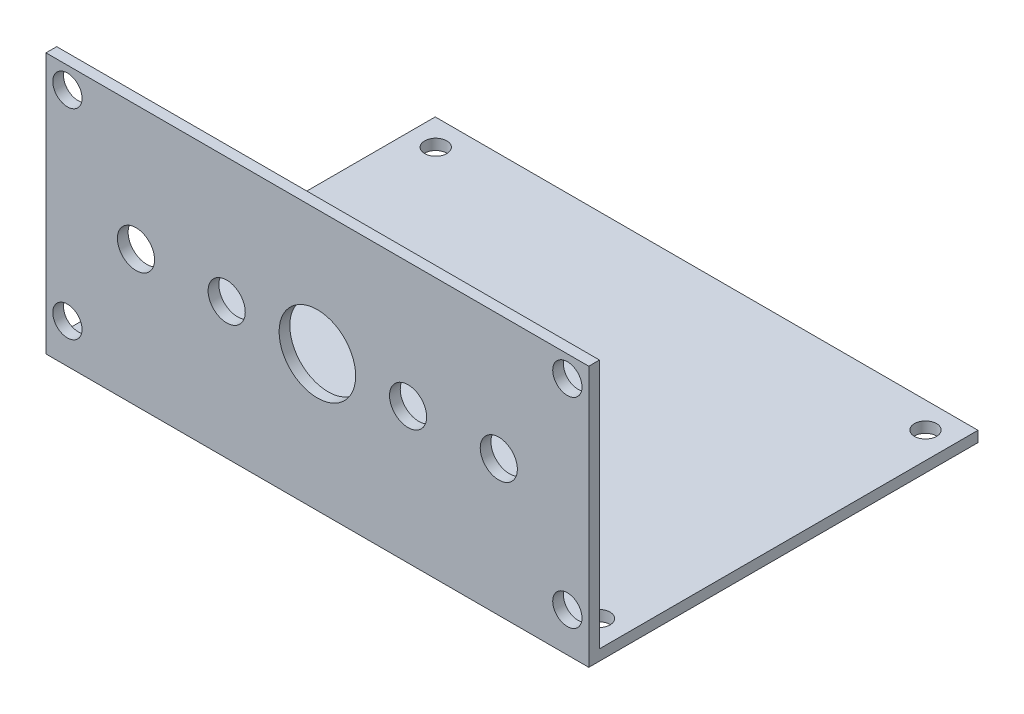
ISO-10303-21;
HEADER;
FILE_DESCRIPTION(('STEP AP214'),'2;1');
FILE_NAME('part.step','',(''),(''),'','','');
FILE_SCHEMA(('AUTOMOTIVE_DESIGN { 1 0 10303 214 1 1 1 1 }'));
ENDSEC;
DATA;
#1=APPLICATION_CONTEXT('core data for automotive mechanical design processes');
#2=APPLICATION_PROTOCOL_DEFINITION('international standard','automotive_design',2000,#1);
#3=PRODUCT_CONTEXT('',#1,'mechanical');
#4=PRODUCT('Part','Part','',(#3));
#5=PRODUCT_RELATED_PRODUCT_CATEGORY('part','',(#4));
#6=PRODUCT_DEFINITION_FORMATION('','',#4);
#7=PRODUCT_DEFINITION_CONTEXT('part definition',#1,'design');
#8=PRODUCT_DEFINITION('design','',#6,#7);
#9=PRODUCT_DEFINITION_SHAPE('','',#8);
#10=(LENGTH_UNIT() NAMED_UNIT(*) SI_UNIT(.MILLI.,.METRE.));
#11=(NAMED_UNIT(*) PLANE_ANGLE_UNIT() SI_UNIT($,.RADIAN.));
#12=(NAMED_UNIT(*) SI_UNIT($,.STERADIAN.) SOLID_ANGLE_UNIT());
#13=UNCERTAINTY_MEASURE_WITH_UNIT(LENGTH_MEASURE(1.E-05),#10,'distance_accuracy_value','');
#14=(GEOMETRIC_REPRESENTATION_CONTEXT(3) GLOBAL_UNCERTAINTY_ASSIGNED_CONTEXT((#13)) GLOBAL_UNIT_ASSIGNED_CONTEXT((#10,
#11,#12)) REPRESENTATION_CONTEXT('',''));
#15=CARTESIAN_POINT('',(0.,0.,0.));
#16=DIRECTION('',(0.,0.,1.));
#17=DIRECTION('',(1.,0.,0.));
#18=AXIS2_PLACEMENT_3D('',#15,#16,#17);
#19=CARTESIAN_POINT('',(0.,1.5,0.));
#20=DIRECTION('',(0.,1.,0.));
#21=DIRECTION('',(0.,0.,1.));
#22=AXIS2_PLACEMENT_3D('',#19,#20,#21);
#23=PLANE('',#22);
#24=DIRECTION('',(-1.,0.,0.));
#25=VECTOR('',#24,1.);
#26=CARTESIAN_POINT('',(-38.,1.5,26.5));
#27=LINE('',#26,#25);
#28=CARTESIAN_POINT('',(38.,1.5,26.5));
#29=VERTEX_POINT('',#28);
#30=CARTESIAN_POINT('',(-38.,1.5,26.5));
#31=VERTEX_POINT('',#30);
#32=EDGE_CURVE('E50',#29,#31,#27,.T.);
#33=ORIENTED_EDGE('',*,*,#32,.F.);
#34=DIRECTION('',(0.,0.,-1.));
#35=VECTOR('',#34,1.);
#36=CARTESIAN_POINT('',(38.,1.5,26.5));
#37=LINE('',#36,#35);
#38=CARTESIAN_POINT('',(38.,1.5,-26.5));
#39=VERTEX_POINT('',#38);
#40=EDGE_CURVE('E99',#29,#39,#37,.T.);
#41=ORIENTED_EDGE('',*,*,#40,.T.);
#42=DIRECTION('',(-1.,0.,0.));
#43=VECTOR('',#42,1.);
#44=CARTESIAN_POINT('',(38.,1.5,-26.5));
#45=LINE('',#44,#43);
#46=CARTESIAN_POINT('',(-38.,1.5,-26.5));
#47=VERTEX_POINT('',#46);
#48=EDGE_CURVE('E56',#39,#47,#45,.T.);
#49=ORIENTED_EDGE('',*,*,#48,.T.);
#50=DIRECTION('',(0.,0.,1.));
#51=VECTOR('',#50,1.);
#52=CARTESIAN_POINT('',(-38.,1.5,26.5));
#53=LINE('',#52,#51);
#54=EDGE_CURVE('E76',#47,#31,#53,.T.);
#55=ORIENTED_EDGE('',*,*,#54,.T.);
#56=EDGE_LOOP('',(#33,#41,#49,#55));
#57=FACE_BOUND('',#56,.T.);
#58=CARTESIAN_POINT('',(34.29,1.5,22.86));
#59=DIRECTION('',(0.,1.,0.));
#60=DIRECTION('',(0.,0.,1.));
#61=AXIS2_PLACEMENT_3D('',#58,#59,#60);
#62=CIRCLE('',#61,1.55);
#63=CARTESIAN_POINT('',(34.29,1.5,24.41));
#64=VERTEX_POINT('',#63);
#65=EDGE_CURVE('E108',#64,#64,#62,.T.);
#66=ORIENTED_EDGE('',*,*,#65,.F.);
#67=EDGE_LOOP('',(#66));
#68=FACE_BOUND('',#67,.T.);
#69=CARTESIAN_POINT('',(-34.29,1.5,-22.86));
#70=DIRECTION('',(0.,1.,0.));
#71=DIRECTION('',(0.,0.,1.));
#72=AXIS2_PLACEMENT_3D('',#69,#70,#71);
#73=CIRCLE('',#72,1.55);
#74=CARTESIAN_POINT('',(-34.29,1.5,-21.31));
#75=VERTEX_POINT('',#74);
#76=EDGE_CURVE('E91',#75,#75,#73,.T.);
#77=ORIENTED_EDGE('',*,*,#76,.F.);
#78=EDGE_LOOP('',(#77));
#79=FACE_BOUND('',#78,.T.);
#80=CARTESIAN_POINT('',(-34.29,1.5,22.86));
#81=DIRECTION('',(0.,1.,0.));
#82=DIRECTION('',(0.,0.,1.));
#83=AXIS2_PLACEMENT_3D('',#80,#81,#82);
#84=CIRCLE('',#83,1.55);
#85=CARTESIAN_POINT('',(-34.29,1.5,24.41));
#86=VERTEX_POINT('',#85);
#87=EDGE_CURVE('E103',#86,#86,#84,.T.);
#88=ORIENTED_EDGE('',*,*,#87,.F.);
#89=EDGE_LOOP('',(#88));
#90=FACE_BOUND('',#89,.T.);
#91=CARTESIAN_POINT('',(34.29,1.5,-22.86));
#92=DIRECTION('',(0.,1.,0.));
#93=DIRECTION('',(0.,0.,1.));
#94=AXIS2_PLACEMENT_3D('',#91,#92,#93);
#95=CIRCLE('',#94,1.55);
#96=CARTESIAN_POINT('',(34.29,1.5,-21.31));
#97=VERTEX_POINT('',#96);
#98=EDGE_CURVE('E114',#97,#97,#95,.T.);
#99=ORIENTED_EDGE('',*,*,#98,.F.);
#100=EDGE_LOOP('',(#99));
#101=FACE_BOUND('',#100,.T.);
#102=ADVANCED_FACE('F35',(#57,#68,#79,#90,#101),#23,.T.);
#103=CARTESIAN_POINT('',(0.,0.,0.));
#104=DIRECTION('',(0.,1.,0.));
#105=DIRECTION('',(0.,0.,1.));
#106=AXIS2_PLACEMENT_3D('',#103,#104,#105);
#107=PLANE('',#106);
#108=DIRECTION('',(0.,0.,1.));
#109=VECTOR('',#108,1.);
#110=CARTESIAN_POINT('',(-38.,0.,26.5));
#111=LINE('',#110,#109);
#112=CARTESIAN_POINT('',(-38.,0.,-26.5));
#113=VERTEX_POINT('',#112);
#114=CARTESIAN_POINT('',(-38.,0.,28.));
#115=VERTEX_POINT('',#114);
#116=EDGE_CURVE('E83',#113,#115,#111,.T.);
#117=ORIENTED_EDGE('',*,*,#116,.F.);
#118=DIRECTION('',(-1.,0.,0.));
#119=VECTOR('',#118,1.);
#120=CARTESIAN_POINT('',(38.,0.,-26.5));
#121=LINE('',#120,#119);
#122=CARTESIAN_POINT('',(38.,0.,-26.5));
#123=VERTEX_POINT('',#122);
#124=EDGE_CURVE('E68',#123,#113,#121,.T.);
#125=ORIENTED_EDGE('',*,*,#124,.F.);
#126=DIRECTION('',(0.,0.,-1.));
#127=VECTOR('',#126,1.);
#128=CARTESIAN_POINT('',(38.,0.,26.5));
#129=LINE('',#128,#127);
#130=CARTESIAN_POINT('',(38.,0.,28.));
#131=VERTEX_POINT('',#130);
#132=EDGE_CURVE('E77',#131,#123,#129,.T.);
#133=ORIENTED_EDGE('',*,*,#132,.F.);
#134=DIRECTION('',(1.,0.,0.));
#135=VECTOR('',#134,1.);
#136=CARTESIAN_POINT('',(-38.,0.,28.));
#137=LINE('',#136,#135);
#138=EDGE_CURVE('E89',#115,#131,#137,.T.);
#139=ORIENTED_EDGE('',*,*,#138,.F.);
#140=EDGE_LOOP('',(#117,#125,#133,#139));
#141=FACE_BOUND('',#140,.T.);
#142=CARTESIAN_POINT('',(-34.29,0.,-22.86));
#143=DIRECTION('',(0.,1.,0.));
#144=DIRECTION('',(0.,0.,1.));
#145=AXIS2_PLACEMENT_3D('',#142,#143,#144);
#146=CIRCLE('',#145,1.55);
#147=CARTESIAN_POINT('',(-34.29,0.,-21.31));
#148=VERTEX_POINT('',#147);
#149=EDGE_CURVE('E95',#148,#148,#146,.T.);
#150=ORIENTED_EDGE('',*,*,#149,.T.);
#151=EDGE_LOOP('',(#150));
#152=FACE_BOUND('',#151,.T.);
#153=CARTESIAN_POINT('',(-34.29,0.,22.86));
#154=DIRECTION('',(0.,1.,0.));
#155=DIRECTION('',(0.,0.,1.));
#156=AXIS2_PLACEMENT_3D('',#153,#154,#155);
#157=CIRCLE('',#156,1.55);
#158=CARTESIAN_POINT('',(-34.29,0.,24.41));
#159=VERTEX_POINT('',#158);
#160=EDGE_CURVE('E105',#159,#159,#157,.T.);
#161=ORIENTED_EDGE('',*,*,#160,.T.);
#162=EDGE_LOOP('',(#161));
#163=FACE_BOUND('',#162,.T.);
#164=CARTESIAN_POINT('',(34.29,0.,22.86));
#165=DIRECTION('',(0.,1.,0.));
#166=DIRECTION('',(0.,0.,1.));
#167=AXIS2_PLACEMENT_3D('',#164,#165,#166);
#168=CIRCLE('',#167,1.55);
#169=CARTESIAN_POINT('',(34.29,0.,24.41));
#170=VERTEX_POINT('',#169);
#171=EDGE_CURVE('E111',#170,#170,#168,.T.);
#172=ORIENTED_EDGE('',*,*,#171,.T.);
#173=EDGE_LOOP('',(#172));
#174=FACE_BOUND('',#173,.T.);
#175=CARTESIAN_POINT('',(34.29,0.,-22.86));
#176=DIRECTION('',(0.,1.,0.));
#177=DIRECTION('',(0.,0.,1.));
#178=AXIS2_PLACEMENT_3D('',#175,#176,#177);
#179=CIRCLE('',#178,1.55);
#180=CARTESIAN_POINT('',(34.29,0.,-21.31));
#181=VERTEX_POINT('',#180);
#182=EDGE_CURVE('E117',#181,#181,#179,.T.);
#183=ORIENTED_EDGE('',*,*,#182,.T.);
#184=EDGE_LOOP('',(#183));
#185=FACE_BOUND('',#184,.T.);
#186=ADVANCED_FACE('F86',(#141,#152,#163,#174,#185),#107,.F.);
#187=CARTESIAN_POINT('',(-38.,1.5,26.5));
#188=DIRECTION('',(1.,0.,0.));
#189=DIRECTION('',(0.,0.,-1.));
#190=AXIS2_PLACEMENT_3D('',#187,#188,#189);
#191=PLANE('',#190);
#192=ORIENTED_EDGE('',*,*,#116,.T.);
#193=DIRECTION('',(0.,-1.,0.));
#194=VECTOR('',#193,1.);
#195=CARTESIAN_POINT('',(-38.,1.5,28.));
#196=LINE('',#195,#194);
#197=CARTESIAN_POINT('',(-38.,36.52,28.));
#198=VERTEX_POINT('',#197);
#199=EDGE_CURVE('E126',#198,#115,#196,.T.);
#200=ORIENTED_EDGE('',*,*,#199,.F.);
#201=DIRECTION('',(0.,0.,1.));
#202=VECTOR('',#201,1.);
#203=CARTESIAN_POINT('',(-38.,36.52,28.));
#204=LINE('',#203,#202);
#205=CARTESIAN_POINT('',(-38.,36.52,26.5));
#206=VERTEX_POINT('',#205);
#207=EDGE_CURVE('E135',#206,#198,#204,.T.);
#208=ORIENTED_EDGE('',*,*,#207,.F.);
#209=DIRECTION('',(0.,-1.,0.));
#210=VECTOR('',#209,1.);
#211=CARTESIAN_POINT('',(-38.,36.52,26.5));
#212=LINE('',#211,#210);
#213=EDGE_CURVE('E131',#206,#31,#212,.T.);
#214=ORIENTED_EDGE('',*,*,#213,.T.);
#215=ORIENTED_EDGE('',*,*,#54,.F.);
#216=DIRECTION('',(0.,-1.,0.));
#217=VECTOR('',#216,1.);
#218=CARTESIAN_POINT('',(-38.,1.5,-26.5));
#219=LINE('',#218,#217);
#220=EDGE_CURVE('E43',#47,#113,#219,.T.);
#221=ORIENTED_EDGE('',*,*,#220,.T.);
#222=EDGE_LOOP('',(#192,#200,#208,#214,#215,#221));
#223=FACE_BOUND('',#222,.T.);
#224=ADVANCED_FACE('F37',(#223),#191,.F.);
#225=CARTESIAN_POINT('',(38.,1.5,26.5));
#226=DIRECTION('',(-1.,0.,0.));
#227=DIRECTION('',(0.,0.,1.));
#228=AXIS2_PLACEMENT_3D('',#225,#226,#227);
#229=PLANE('',#228);
#230=ORIENTED_EDGE('',*,*,#132,.T.);
#231=DIRECTION('',(0.,-1.,0.));
#232=VECTOR('',#231,1.);
#233=CARTESIAN_POINT('',(38.,1.5,-26.5));
#234=LINE('',#233,#232);
#235=EDGE_CURVE('E11',#39,#123,#234,.T.);
#236=ORIENTED_EDGE('',*,*,#235,.F.);
#237=ORIENTED_EDGE('',*,*,#40,.F.);
#238=DIRECTION('',(0.,-1.,0.));
#239=VECTOR('',#238,1.);
#240=CARTESIAN_POINT('',(38.,36.52,26.5));
#241=LINE('',#240,#239);
#242=CARTESIAN_POINT('',(38.,36.52,26.5));
#243=VERTEX_POINT('',#242);
#244=EDGE_CURVE('E128',#243,#29,#241,.T.);
#245=ORIENTED_EDGE('',*,*,#244,.F.);
#246=DIRECTION('',(0.,0.,-1.));
#247=VECTOR('',#246,1.);
#248=CARTESIAN_POINT('',(38.,36.52,28.));
#249=LINE('',#248,#247);
#250=CARTESIAN_POINT('',(38.,36.52,28.));
#251=VERTEX_POINT('',#250);
#252=EDGE_CURVE('E139',#251,#243,#249,.T.);
#253=ORIENTED_EDGE('',*,*,#252,.F.);
#254=DIRECTION('',(0.,-1.,0.));
#255=VECTOR('',#254,1.);
#256=CARTESIAN_POINT('',(38.,1.5,28.));
#257=LINE('',#256,#255);
#258=EDGE_CURVE('E120',#251,#131,#257,.T.);
#259=ORIENTED_EDGE('',*,*,#258,.T.);
#260=EDGE_LOOP('',(#230,#236,#237,#245,#253,#259));
#261=FACE_BOUND('',#260,.T.);
#262=ADVANCED_FACE('F243',(#261),#229,.F.);
#263=CARTESIAN_POINT('',(38.,1.5,-26.5));
#264=DIRECTION('',(0.,0.,1.));
#265=DIRECTION('',(1.,0.,0.));
#266=AXIS2_PLACEMENT_3D('',#263,#264,#265);
#267=PLANE('',#266);
#268=ORIENTED_EDGE('',*,*,#124,.T.);
#269=ORIENTED_EDGE('',*,*,#220,.F.);
#270=ORIENTED_EDGE('',*,*,#48,.F.);
#271=ORIENTED_EDGE('',*,*,#235,.T.);
#272=EDGE_LOOP('',(#268,#269,#270,#271));
#273=FACE_BOUND('',#272,.T.);
#274=ADVANCED_FACE('F70',(#273),#267,.F.);
#275=CARTESIAN_POINT('',(-34.29,1.5,-22.86));
#276=DIRECTION('',(0.,-1.,0.));
#277=DIRECTION('',(0.,0.,-1.));
#278=AXIS2_PLACEMENT_3D('',#275,#276,#277);
#279=CYLINDRICAL_SURFACE('',#278,1.55);
#280=ORIENTED_EDGE('',*,*,#76,.T.);
#281=EDGE_LOOP('',(#280));
#282=FACE_BOUND('',#281,.T.);
#283=ORIENTED_EDGE('',*,*,#149,.F.);
#284=EDGE_LOOP('',(#283));
#285=FACE_BOUND('',#284,.T.);
#286=ADVANCED_FACE('F270',(#282,#285),#279,.F.);
#287=CARTESIAN_POINT('',(-34.29,1.5,22.86));
#288=DIRECTION('',(0.,-1.,0.));
#289=DIRECTION('',(0.,0.,-1.));
#290=AXIS2_PLACEMENT_3D('',#287,#288,#289);
#291=CYLINDRICAL_SURFACE('',#290,1.55);
#292=ORIENTED_EDGE('',*,*,#87,.T.);
#293=EDGE_LOOP('',(#292));
#294=FACE_BOUND('',#293,.T.);
#295=ORIENTED_EDGE('',*,*,#160,.F.);
#296=EDGE_LOOP('',(#295));
#297=FACE_BOUND('',#296,.T.);
#298=ADVANCED_FACE('F287',(#294,#297),#291,.F.);
#299=CARTESIAN_POINT('',(34.29,1.5,22.86));
#300=DIRECTION('',(0.,-1.,0.));
#301=DIRECTION('',(0.,0.,-1.));
#302=AXIS2_PLACEMENT_3D('',#299,#300,#301);
#303=CYLINDRICAL_SURFACE('',#302,1.55);
#304=ORIENTED_EDGE('',*,*,#65,.T.);
#305=EDGE_LOOP('',(#304));
#306=FACE_BOUND('',#305,.T.);
#307=ORIENTED_EDGE('',*,*,#171,.F.);
#308=EDGE_LOOP('',(#307));
#309=FACE_BOUND('',#308,.T.);
#310=ADVANCED_FACE('F258',(#306,#309),#303,.F.);
#311=CARTESIAN_POINT('',(34.29,1.5,-22.86));
#312=DIRECTION('',(0.,-1.,0.));
#313=DIRECTION('',(0.,0.,-1.));
#314=AXIS2_PLACEMENT_3D('',#311,#312,#313);
#315=CYLINDRICAL_SURFACE('',#314,1.55);
#316=ORIENTED_EDGE('',*,*,#98,.T.);
#317=EDGE_LOOP('',(#316));
#318=FACE_BOUND('',#317,.T.);
#319=ORIENTED_EDGE('',*,*,#182,.F.);
#320=EDGE_LOOP('',(#319));
#321=FACE_BOUND('',#320,.T.);
#322=ADVANCED_FACE('F255',(#318,#321),#315,.F.);
#323=CARTESIAN_POINT('',(0.,0.,28.));
#324=DIRECTION('',(0.,0.,1.));
#325=DIRECTION('',(1.,0.,0.));
#326=AXIS2_PLACEMENT_3D('',#323,#324,#325);
#327=PLANE('',#326);
#328=CARTESIAN_POINT('',(-35.,33.52,28.));
#329=DIRECTION('',(0.,0.,1.));
#330=DIRECTION('',(1.,0.,0.));
#331=AXIS2_PLACEMENT_3D('',#328,#329,#330);
#332=CIRCLE('',#331,2.04999999999999);
#333=CARTESIAN_POINT('',(-32.95,33.52,28.));
#334=VERTEX_POINT('',#333);
#335=EDGE_CURVE('E169',#334,#334,#332,.T.);
#336=ORIENTED_EDGE('',*,*,#335,.F.);
#337=EDGE_LOOP('',(#336));
#338=FACE_BOUND('',#337,.T.);
#339=CARTESIAN_POINT('',(-35.,5.5,28.));
#340=DIRECTION('',(0.,0.,1.));
#341=DIRECTION('',(1.,0.,0.));
#342=AXIS2_PLACEMENT_3D('',#339,#340,#341);
#343=CIRCLE('',#342,2.04999999999999);
#344=CARTESIAN_POINT('',(-32.95,5.5,28.));
#345=VERTEX_POINT('',#344);
#346=EDGE_CURVE('E179',#345,#345,#343,.T.);
#347=ORIENTED_EDGE('',*,*,#346,.F.);
#348=EDGE_LOOP('',(#347));
#349=FACE_BOUND('',#348,.T.);
#350=CARTESIAN_POINT('',(35.,5.5,28.));
#351=DIRECTION('',(0.,0.,1.));
#352=DIRECTION('',(1.,0.,0.));
#353=AXIS2_PLACEMENT_3D('',#350,#351,#352);
#354=CIRCLE('',#353,2.05);
#355=CARTESIAN_POINT('',(37.05,5.5,28.));
#356=VERTEX_POINT('',#355);
#357=EDGE_CURVE('E182',#356,#356,#354,.T.);
#358=ORIENTED_EDGE('',*,*,#357,.F.);
#359=EDGE_LOOP('',(#358));
#360=FACE_BOUND('',#359,.T.);
#361=CARTESIAN_POINT('',(35.,33.52,28.));
#362=DIRECTION('',(0.,0.,1.));
#363=DIRECTION('',(1.,0.,0.));
#364=AXIS2_PLACEMENT_3D('',#361,#362,#363);
#365=CIRCLE('',#364,2.04999999999999);
#366=CARTESIAN_POINT('',(37.05,33.52,28.));
#367=VERTEX_POINT('',#366);
#368=EDGE_CURVE('E185',#367,#367,#365,.T.);
#369=ORIENTED_EDGE('',*,*,#368,.F.);
#370=EDGE_LOOP('',(#369));
#371=FACE_BOUND('',#370,.T.);
#372=CARTESIAN_POINT('',(-25.4,19.02,28.));
#373=DIRECTION('',(0.,0.,1.));
#374=DIRECTION('',(1.,0.,0.));
#375=AXIS2_PLACEMENT_3D('',#372,#373,#374);
#376=CIRCLE('',#375,2.600000007);
#377=CARTESIAN_POINT('',(-22.799999993,19.02,28.));
#378=VERTEX_POINT('',#377);
#379=EDGE_CURVE('E136',#378,#378,#376,.T.);
#380=ORIENTED_EDGE('',*,*,#379,.F.);
#381=EDGE_LOOP('',(#380));
#382=FACE_BOUND('',#381,.T.);
#383=CARTESIAN_POINT('',(-12.7,19.02,28.));
#384=DIRECTION('',(0.,0.,1.));
#385=DIRECTION('',(1.,0.,0.));
#386=AXIS2_PLACEMENT_3D('',#383,#384,#385);
#387=CIRCLE('',#386,2.600000007);
#388=CARTESIAN_POINT('',(-10.099999993,19.02,28.));
#389=VERTEX_POINT('',#388);
#390=EDGE_CURVE('E149',#389,#389,#387,.T.);
#391=ORIENTED_EDGE('',*,*,#390,.F.);
#392=EDGE_LOOP('',(#391));
#393=FACE_BOUND('',#392,.T.);
#394=CARTESIAN_POINT('',(25.4,19.02,28.));
#395=DIRECTION('',(0.,0.,1.));
#396=DIRECTION('',(1.,0.,0.));
#397=AXIS2_PLACEMENT_3D('',#394,#395,#396);
#398=CIRCLE('',#397,2.600000007);
#399=CARTESIAN_POINT('',(28.000000007,19.02,28.));
#400=VERTEX_POINT('',#399);
#401=EDGE_CURVE('E152',#400,#400,#398,.T.);
#402=ORIENTED_EDGE('',*,*,#401,.F.);
#403=EDGE_LOOP('',(#402));
#404=FACE_BOUND('',#403,.T.);
#405=CARTESIAN_POINT('',(12.7,19.02,28.));
#406=DIRECTION('',(0.,0.,1.));
#407=DIRECTION('',(1.,0.,0.));
#408=AXIS2_PLACEMENT_3D('',#405,#406,#407);
#409=CIRCLE('',#408,2.600000007);
#410=CARTESIAN_POINT('',(15.300000007,19.02,28.));
#411=VERTEX_POINT('',#410);
#412=EDGE_CURVE('E155',#411,#411,#409,.T.);
#413=ORIENTED_EDGE('',*,*,#412,.F.);
#414=EDGE_LOOP('',(#413));
#415=FACE_BOUND('',#414,.T.);
#416=CARTESIAN_POINT('',(0.,19.02,28.));
#417=DIRECTION('',(0.,0.,1.));
#418=DIRECTION('',(1.,0.,0.));
#419=AXIS2_PLACEMENT_3D('',#416,#417,#418);
#420=CIRCLE('',#419,5.36);
#421=CARTESIAN_POINT('',(5.36,19.02,28.));
#422=VERTEX_POINT('',#421);
#423=EDGE_CURVE('E158',#422,#422,#420,.T.);
#424=ORIENTED_EDGE('',*,*,#423,.F.);
#425=EDGE_LOOP('',(#424));
#426=FACE_BOUND('',#425,.T.);
#427=ORIENTED_EDGE('',*,*,#199,.T.);
#428=ORIENTED_EDGE('',*,*,#138,.T.);
#429=ORIENTED_EDGE('',*,*,#258,.F.);
#430=DIRECTION('',(1.,0.,0.));
#431=VECTOR('',#430,1.);
#432=CARTESIAN_POINT('',(-38.,36.52,28.));
#433=LINE('',#432,#431);
#434=EDGE_CURVE('E142',#198,#251,#433,.T.);
#435=ORIENTED_EDGE('',*,*,#434,.F.);
#436=EDGE_LOOP('',(#427,#428,#429,#435));
#437=FACE_BOUND('',#436,.T.);
#438=ADVANCED_FACE('F207',(#338,#349,#360,#371,#382,#393,#404,#415,#426,#437),#327,.T.);
#439=CARTESIAN_POINT('',(-38.,36.52,26.5));
#440=DIRECTION('',(0.,0.,1.));
#441=DIRECTION('',(1.,0.,0.));
#442=AXIS2_PLACEMENT_3D('',#439,#440,#441);
#443=PLANE('',#442);
#444=CARTESIAN_POINT('',(-35.,33.52,26.5));
#445=DIRECTION('',(0.,0.,-1.));
#446=DIRECTION('',(-1.,0.,0.));
#447=AXIS2_PLACEMENT_3D('',#444,#445,#446);
#448=CIRCLE('',#447,2.04999999999999);
#449=CARTESIAN_POINT('',(-37.05,33.52,26.5));
#450=VERTEX_POINT('',#449);
#451=EDGE_CURVE('E192',#450,#450,#448,.T.);
#452=ORIENTED_EDGE('',*,*,#451,.F.);
#453=EDGE_LOOP('',(#452));
#454=FACE_BOUND('',#453,.T.);
#455=CARTESIAN_POINT('',(-35.,5.5,26.5));
#456=DIRECTION('',(0.,0.,-1.));
#457=DIRECTION('',(-1.,0.,0.));
#458=AXIS2_PLACEMENT_3D('',#455,#456,#457);
#459=CIRCLE('',#458,2.04999999999999);
#460=CARTESIAN_POINT('',(-37.05,5.5,26.5));
#461=VERTEX_POINT('',#460);
#462=EDGE_CURVE('E195',#461,#461,#459,.T.);
#463=ORIENTED_EDGE('',*,*,#462,.F.);
#464=EDGE_LOOP('',(#463));
#465=FACE_BOUND('',#464,.T.);
#466=CARTESIAN_POINT('',(35.,5.5,26.5));
#467=DIRECTION('',(0.,0.,-1.));
#468=DIRECTION('',(-1.,0.,0.));
#469=AXIS2_PLACEMENT_3D('',#466,#467,#468);
#470=CIRCLE('',#469,2.05);
#471=CARTESIAN_POINT('',(32.95,5.5,26.5));
#472=VERTEX_POINT('',#471);
#473=EDGE_CURVE('E191',#472,#472,#470,.T.);
#474=ORIENTED_EDGE('',*,*,#473,.F.);
#475=EDGE_LOOP('',(#474));
#476=FACE_BOUND('',#475,.T.);
#477=CARTESIAN_POINT('',(35.,33.52,26.5));
#478=DIRECTION('',(0.,0.,-1.));
#479=DIRECTION('',(-1.,0.,0.));
#480=AXIS2_PLACEMENT_3D('',#477,#478,#479);
#481=CIRCLE('',#480,2.04999999999999);
#482=CARTESIAN_POINT('',(32.95,33.52,26.5));
#483=VERTEX_POINT('',#482);
#484=EDGE_CURVE('E188',#483,#483,#481,.T.);
#485=ORIENTED_EDGE('',*,*,#484,.F.);
#486=EDGE_LOOP('',(#485));
#487=FACE_BOUND('',#486,.T.);
#488=CARTESIAN_POINT('',(-25.4,19.02,26.5));
#489=DIRECTION('',(0.,0.,-1.));
#490=DIRECTION('',(-1.,0.,0.));
#491=AXIS2_PLACEMENT_3D('',#488,#489,#490);
#492=CIRCLE('',#491,2.600000007);
#493=CARTESIAN_POINT('',(-28.000000007,19.02,26.5));
#494=VERTEX_POINT('',#493);
#495=EDGE_CURVE('E165',#494,#494,#492,.T.);
#496=ORIENTED_EDGE('',*,*,#495,.F.);
#497=EDGE_LOOP('',(#496));
#498=FACE_BOUND('',#497,.T.);
#499=CARTESIAN_POINT('',(-12.7,19.02,26.5));
#500=DIRECTION('',(0.,0.,-1.));
#501=DIRECTION('',(-1.,0.,0.));
#502=AXIS2_PLACEMENT_3D('',#499,#500,#501);
#503=CIRCLE('',#502,2.600000007);
#504=CARTESIAN_POINT('',(-15.300000007,19.02,26.5));
#505=VERTEX_POINT('',#504);
#506=EDGE_CURVE('E168',#505,#505,#503,.T.);
#507=ORIENTED_EDGE('',*,*,#506,.F.);
#508=EDGE_LOOP('',(#507));
#509=FACE_BOUND('',#508,.T.);
#510=CARTESIAN_POINT('',(25.4,19.02,26.5));
#511=DIRECTION('',(0.,0.,-1.));
#512=DIRECTION('',(-1.,0.,0.));
#513=AXIS2_PLACEMENT_3D('',#510,#511,#512);
#514=CIRCLE('',#513,2.600000007);
#515=CARTESIAN_POINT('',(22.799999993,19.02,26.5));
#516=VERTEX_POINT('',#515);
#517=EDGE_CURVE('E172',#516,#516,#514,.T.);
#518=ORIENTED_EDGE('',*,*,#517,.F.);
#519=EDGE_LOOP('',(#518));
#520=FACE_BOUND('',#519,.T.);
#521=CARTESIAN_POINT('',(12.7,19.02,26.5));
#522=DIRECTION('',(0.,0.,-1.));
#523=DIRECTION('',(-1.,0.,0.));
#524=AXIS2_PLACEMENT_3D('',#521,#522,#523);
#525=CIRCLE('',#524,2.600000007);
#526=CARTESIAN_POINT('',(10.099999993,19.02,26.5));
#527=VERTEX_POINT('',#526);
#528=EDGE_CURVE('E164',#527,#527,#525,.T.);
#529=ORIENTED_EDGE('',*,*,#528,.F.);
#530=EDGE_LOOP('',(#529));
#531=FACE_BOUND('',#530,.T.);
#532=CARTESIAN_POINT('',(0.,19.02,26.5));
#533=DIRECTION('',(0.,0.,-1.));
#534=DIRECTION('',(-1.,0.,0.));
#535=AXIS2_PLACEMENT_3D('',#532,#533,#534);
#536=CIRCLE('',#535,5.36);
#537=CARTESIAN_POINT('',(-5.36,19.02,26.5));
#538=VERTEX_POINT('',#537);
#539=EDGE_CURVE('E161',#538,#538,#536,.T.);
#540=ORIENTED_EDGE('',*,*,#539,.F.);
#541=EDGE_LOOP('',(#540));
#542=FACE_BOUND('',#541,.T.);
#543=ORIENTED_EDGE('',*,*,#32,.T.);
#544=ORIENTED_EDGE('',*,*,#213,.F.);
#545=DIRECTION('',(-1.,0.,0.));
#546=VECTOR('',#545,1.);
#547=CARTESIAN_POINT('',(-38.,36.52,26.5));
#548=LINE('',#547,#546);
#549=EDGE_CURVE('E133',#243,#206,#548,.T.);
#550=ORIENTED_EDGE('',*,*,#549,.F.);
#551=ORIENTED_EDGE('',*,*,#244,.T.);
#552=EDGE_LOOP('',(#543,#544,#550,#551));
#553=FACE_BOUND('',#552,.T.);
#554=ADVANCED_FACE('F203',(#454,#465,#476,#487,#498,#509,#520,#531,#542,#553),#443,.F.);
#555=CARTESIAN_POINT('',(0.,36.52,0.));
#556=DIRECTION('',(0.,-1.,0.));
#557=DIRECTION('',(0.,0.,-1.));
#558=AXIS2_PLACEMENT_3D('',#555,#556,#557);
#559=PLANE('',#558);
#560=ORIENTED_EDGE('',*,*,#207,.T.);
#561=ORIENTED_EDGE('',*,*,#434,.T.);
#562=ORIENTED_EDGE('',*,*,#252,.T.);
#563=ORIENTED_EDGE('',*,*,#549,.T.);
#564=EDGE_LOOP('',(#560,#561,#562,#563));
#565=FACE_BOUND('',#564,.T.);
#566=ADVANCED_FACE('F206',(#565),#559,.F.);
#567=CARTESIAN_POINT('',(0.,19.02,86.5));
#568=DIRECTION('',(0.,0.,-1.));
#569=DIRECTION('',(-1.,0.,0.));
#570=AXIS2_PLACEMENT_3D('',#567,#568,#569);
#571=CYLINDRICAL_SURFACE('',#570,5.36);
#572=ORIENTED_EDGE('',*,*,#423,.T.);
#573=EDGE_LOOP('',(#572));
#574=FACE_BOUND('',#573,.T.);
#575=ORIENTED_EDGE('',*,*,#539,.T.);
#576=EDGE_LOOP('',(#575));
#577=FACE_BOUND('',#576,.T.);
#578=ADVANCED_FACE('F330',(#574,#577),#571,.F.);
#579=CARTESIAN_POINT('',(12.7,19.02,86.5));
#580=DIRECTION('',(0.,0.,-1.));
#581=DIRECTION('',(-1.,0.,0.));
#582=AXIS2_PLACEMENT_3D('',#579,#580,#581);
#583=CYLINDRICAL_SURFACE('',#582,2.600000007);
#584=ORIENTED_EDGE('',*,*,#412,.T.);
#585=EDGE_LOOP('',(#584));
#586=FACE_BOUND('',#585,.T.);
#587=ORIENTED_EDGE('',*,*,#528,.T.);
#588=EDGE_LOOP('',(#587));
#589=FACE_BOUND('',#588,.T.);
#590=ADVANCED_FACE('F336',(#586,#589),#583,.F.);
#591=CARTESIAN_POINT('',(25.4,19.02,86.5));
#592=DIRECTION('',(0.,0.,-1.));
#593=DIRECTION('',(-1.,0.,0.));
#594=AXIS2_PLACEMENT_3D('',#591,#592,#593);
#595=CYLINDRICAL_SURFACE('',#594,2.600000007);
#596=ORIENTED_EDGE('',*,*,#401,.T.);
#597=EDGE_LOOP('',(#596));
#598=FACE_BOUND('',#597,.T.);
#599=ORIENTED_EDGE('',*,*,#517,.T.);
#600=EDGE_LOOP('',(#599));
#601=FACE_BOUND('',#600,.T.);
#602=ADVANCED_FACE('F344',(#598,#601),#595,.F.);
#603=CARTESIAN_POINT('',(-12.7,19.02,86.5));
#604=DIRECTION('',(0.,0.,-1.));
#605=DIRECTION('',(-1.,0.,0.));
#606=AXIS2_PLACEMENT_3D('',#603,#604,#605);
#607=CYLINDRICAL_SURFACE('',#606,2.600000007);
#608=ORIENTED_EDGE('',*,*,#390,.T.);
#609=EDGE_LOOP('',(#608));
#610=FACE_BOUND('',#609,.T.);
#611=ORIENTED_EDGE('',*,*,#506,.T.);
#612=EDGE_LOOP('',(#611));
#613=FACE_BOUND('',#612,.T.);
#614=ADVANCED_FACE('F352',(#610,#613),#607,.F.);
#615=CARTESIAN_POINT('',(-25.4,19.02,86.5));
#616=DIRECTION('',(0.,0.,-1.));
#617=DIRECTION('',(-1.,0.,0.));
#618=AXIS2_PLACEMENT_3D('',#615,#616,#617);
#619=CYLINDRICAL_SURFACE('',#618,2.600000007);
#620=ORIENTED_EDGE('',*,*,#379,.T.);
#621=EDGE_LOOP('',(#620));
#622=FACE_BOUND('',#621,.T.);
#623=ORIENTED_EDGE('',*,*,#495,.T.);
#624=EDGE_LOOP('',(#623));
#625=FACE_BOUND('',#624,.T.);
#626=ADVANCED_FACE('F360',(#622,#625),#619,.F.);
#627=CARTESIAN_POINT('',(35.,33.52,36.5));
#628=DIRECTION('',(0.,0.,-1.));
#629=DIRECTION('',(-1.,0.,0.));
#630=AXIS2_PLACEMENT_3D('',#627,#628,#629);
#631=CYLINDRICAL_SURFACE('',#630,2.04999999999999);
#632=ORIENTED_EDGE('',*,*,#368,.T.);
#633=EDGE_LOOP('',(#632));
#634=FACE_BOUND('',#633,.T.);
#635=ORIENTED_EDGE('',*,*,#484,.T.);
#636=EDGE_LOOP('',(#635));
#637=FACE_BOUND('',#636,.T.);
#638=ADVANCED_FACE('F367',(#634,#637),#631,.F.);
#639=CARTESIAN_POINT('',(35.,5.5,36.5));
#640=DIRECTION('',(0.,0.,-1.));
#641=DIRECTION('',(-1.,0.,0.));
#642=AXIS2_PLACEMENT_3D('',#639,#640,#641);
#643=CYLINDRICAL_SURFACE('',#642,2.05);
#644=ORIENTED_EDGE('',*,*,#357,.T.);
#645=EDGE_LOOP('',(#644));
#646=FACE_BOUND('',#645,.T.);
#647=ORIENTED_EDGE('',*,*,#473,.T.);
#648=EDGE_LOOP('',(#647));
#649=FACE_BOUND('',#648,.T.);
#650=ADVANCED_FACE('F201',(#646,#649),#643,.F.);
#651=CARTESIAN_POINT('',(-35.,5.5,36.5));
#652=DIRECTION('',(0.,0.,-1.));
#653=DIRECTION('',(-1.,0.,0.));
#654=AXIS2_PLACEMENT_3D('',#651,#652,#653);
#655=CYLINDRICAL_SURFACE('',#654,2.04999999999999);
#656=ORIENTED_EDGE('',*,*,#346,.T.);
#657=EDGE_LOOP('',(#656));
#658=FACE_BOUND('',#657,.T.);
#659=ORIENTED_EDGE('',*,*,#462,.T.);
#660=EDGE_LOOP('',(#659));
#661=FACE_BOUND('',#660,.T.);
#662=ADVANCED_FACE('F381',(#658,#661),#655,.F.);
#663=CARTESIAN_POINT('',(-35.,33.52,36.5));
#664=DIRECTION('',(0.,0.,-1.));
#665=DIRECTION('',(-1.,0.,0.));
#666=AXIS2_PLACEMENT_3D('',#663,#664,#665);
#667=CYLINDRICAL_SURFACE('',#666,2.04999999999999);
#668=ORIENTED_EDGE('',*,*,#335,.T.);
#669=EDGE_LOOP('',(#668));
#670=FACE_BOUND('',#669,.T.);
#671=ORIENTED_EDGE('',*,*,#451,.T.);
#672=EDGE_LOOP('',(#671));
#673=FACE_BOUND('',#672,.T.);
#674=ADVANCED_FACE('F389',(#670,#673),#667,.F.);
#675=CLOSED_SHELL('',(#102,#186,#224,#262,#274,#286,#298,#310,#322,#438,#554,#566,#578,#590,
#602,#614,#626,#638,#650,#662,#674));
#676=MANIFOLD_SOLID_BREP('B2',#675);
#677=ADVANCED_BREP_SHAPE_REPRESENTATION('',(#18,#676),#14);
#678=SHAPE_DEFINITION_REPRESENTATION(#9,#677);
ENDSEC;
END-ISO-10303-21;
